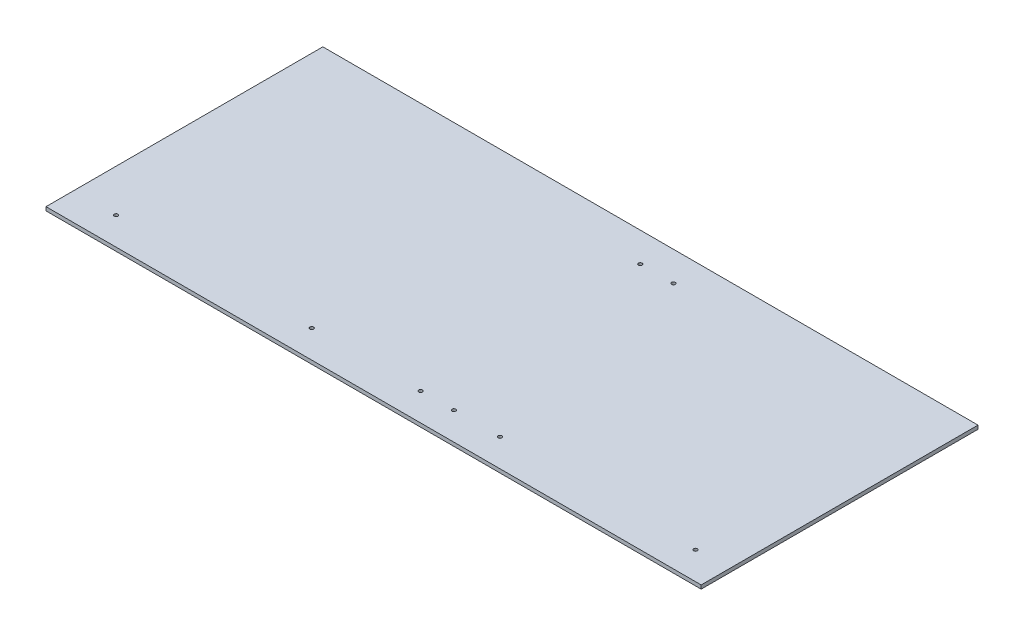
ISO-10303-21;
HEADER;
FILE_DESCRIPTION(('STEP AP214'),'2;1');
FILE_NAME('part.step','',(''),(''),'','','');
FILE_SCHEMA(('AUTOMOTIVE_DESIGN { 1 0 10303 214 1 1 1 1 }'));
ENDSEC;
DATA;
#1=APPLICATION_CONTEXT('core data for automotive mechanical design processes');
#2=APPLICATION_PROTOCOL_DEFINITION('international standard','automotive_design',2000,#1);
#3=PRODUCT_CONTEXT('',#1,'mechanical');
#4=PRODUCT('Part','Part','',(#3));
#5=PRODUCT_RELATED_PRODUCT_CATEGORY('part','',(#4));
#6=PRODUCT_DEFINITION_FORMATION('','',#4);
#7=PRODUCT_DEFINITION_CONTEXT('part definition',#1,'design');
#8=PRODUCT_DEFINITION('design','',#6,#7);
#9=PRODUCT_DEFINITION_SHAPE('','',#8);
#10=(LENGTH_UNIT() NAMED_UNIT(*) SI_UNIT(.MILLI.,.METRE.));
#11=(NAMED_UNIT(*) PLANE_ANGLE_UNIT() SI_UNIT($,.RADIAN.));
#12=(NAMED_UNIT(*) SI_UNIT($,.STERADIAN.) SOLID_ANGLE_UNIT());
#13=UNCERTAINTY_MEASURE_WITH_UNIT(LENGTH_MEASURE(1.E-05),#10,'distance_accuracy_value','');
#14=(GEOMETRIC_REPRESENTATION_CONTEXT(3) GLOBAL_UNCERTAINTY_ASSIGNED_CONTEXT((#13)) GLOBAL_UNIT_ASSIGNED_CONTEXT((#10,
#11,#12)) REPRESENTATION_CONTEXT('',''));
#15=CARTESIAN_POINT('',(0.,0.,0.));
#16=DIRECTION('',(0.,0.,1.));
#17=DIRECTION('',(1.,0.,0.));
#18=AXIS2_PLACEMENT_3D('',#15,#16,#17);
#19=CARTESIAN_POINT('',(-614.3625,0.,238.125));
#20=DIRECTION('',(0.,-1.,0.));
#21=DIRECTION('',(0.,0.,-1.));
#22=AXIS2_PLACEMENT_3D('',#19,#20,#21);
#23=PLANE('',#22);
#24=DIRECTION('',(0.,0.,1.));
#25=VECTOR('',#24,1.);
#26=CARTESIAN_POINT('',(-1177.925,0.,238.125));
#27=LINE('',#26,#25);
#28=CARTESIAN_POINT('',(-1177.925,0.,476.25));
#29=VERTEX_POINT('',#28);
#30=CARTESIAN_POINT('',(-1177.925,0.,0.));
#31=VERTEX_POINT('',#30);
#32=EDGE_CURVE('E309',#29,#31,#27,.F.);
#33=ORIENTED_EDGE('',*,*,#32,.F.);
#34=DIRECTION('',(-1.,0.,0.));
#35=VECTOR('',#34,1.);
#36=CARTESIAN_POINT('',(-614.3625,0.,476.25));
#37=LINE('',#36,#35);
#38=CARTESIAN_POINT('',(-50.8,0.,476.25));
#39=VERTEX_POINT('',#38);
#40=EDGE_CURVE('E69',#29,#39,#37,.F.);
#41=ORIENTED_EDGE('',*,*,#40,.T.);
#42=DIRECTION('',(0.,0.,1.));
#43=VECTOR('',#42,1.);
#44=CARTESIAN_POINT('',(-50.8,0.,238.125));
#45=LINE('',#44,#43);
#46=CARTESIAN_POINT('',(-50.8,0.,0.));
#47=VERTEX_POINT('',#46);
#48=EDGE_CURVE('E53',#39,#47,#45,.F.);
#49=ORIENTED_EDGE('',*,*,#48,.T.);
#50=DIRECTION('',(-1.,0.,0.));
#51=VECTOR('',#50,1.);
#52=CARTESIAN_POINT('',(-614.3625,0.,0.));
#53=LINE('',#52,#51);
#54=EDGE_CURVE('E58',#31,#47,#53,.F.);
#55=ORIENTED_EDGE('',*,*,#54,.F.);
#56=EDGE_LOOP('',(#33,#41,#49,#55));
#57=FACE_BOUND('',#56,.T.);
#58=CARTESIAN_POINT('',(-1104.9,0.,428.625));
#59=DIRECTION('',(0.,-1.,0.));
#60=DIRECTION('',(0.,0.,-1.));
#61=AXIS2_PLACEMENT_3D('',#58,#59,#60);
#62=CIRCLE('',#61,3.175);
#63=CARTESIAN_POINT('',(-1104.9,0.,425.45));
#64=VERTEX_POINT('',#63);
#65=EDGE_CURVE('E66',#64,#64,#62,.T.);
#66=ORIENTED_EDGE('',*,*,#65,.T.);
#67=EDGE_LOOP('',(#66));
#68=FACE_BOUND('',#67,.T.);
#69=CARTESIAN_POINT('',(-581.025,0.,428.625));
#70=DIRECTION('',(0.,-1.,0.));
#71=DIRECTION('',(0.,0.,-1.));
#72=AXIS2_PLACEMENT_3D('',#69,#70,#71);
#73=CIRCLE('',#72,3.175);
#74=CARTESIAN_POINT('',(-581.025,0.,425.45));
#75=VERTEX_POINT('',#74);
#76=EDGE_CURVE('E107',#75,#75,#73,.T.);
#77=ORIENTED_EDGE('',*,*,#76,.T.);
#78=EDGE_LOOP('',(#77));
#79=FACE_BOUND('',#78,.T.);
#80=CARTESIAN_POINT('',(-523.875,0.,428.625));
#81=DIRECTION('',(0.,-1.,0.));
#82=DIRECTION('',(0.,0.,-1.));
#83=AXIS2_PLACEMENT_3D('',#80,#81,#82);
#84=CIRCLE('',#83,3.175);
#85=CARTESIAN_POINT('',(-523.875,0.,425.45));
#86=VERTEX_POINT('',#85);
#87=EDGE_CURVE('E110',#86,#86,#84,.T.);
#88=ORIENTED_EDGE('',*,*,#87,.T.);
#89=EDGE_LOOP('',(#88));
#90=FACE_BOUND('',#89,.T.);
#91=CARTESIAN_POINT('',(-107.95,0.,428.625));
#92=DIRECTION('',(0.,-1.,0.));
#93=DIRECTION('',(0.,0.,-1.));
#94=AXIS2_PLACEMENT_3D('',#91,#92,#93);
#95=CIRCLE('',#94,3.175);
#96=CARTESIAN_POINT('',(-107.95,0.,425.45));
#97=VERTEX_POINT('',#96);
#98=EDGE_CURVE('E113',#97,#97,#95,.T.);
#99=ORIENTED_EDGE('',*,*,#98,.T.);
#100=EDGE_LOOP('',(#99));
#101=FACE_BOUND('',#100,.T.);
#102=CARTESIAN_POINT('',(-523.875,0.,50.8));
#103=DIRECTION('',(0.,-1.,0.));
#104=DIRECTION('',(0.,0.,-1.));
#105=AXIS2_PLACEMENT_3D('',#102,#103,#104);
#106=CIRCLE('',#105,3.175);
#107=CARTESIAN_POINT('',(-523.875,0.,47.625));
#108=VERTEX_POINT('',#107);
#109=EDGE_CURVE('E116',#108,#108,#106,.T.);
#110=ORIENTED_EDGE('',*,*,#109,.T.);
#111=EDGE_LOOP('',(#110));
#112=FACE_BOUND('',#111,.T.);
#113=CARTESIAN_POINT('',(-581.025,0.,50.8));
#114=DIRECTION('',(0.,-1.,0.));
#115=DIRECTION('',(0.,0.,-1.));
#116=AXIS2_PLACEMENT_3D('',#113,#114,#115);
#117=CIRCLE('',#116,3.175);
#118=CARTESIAN_POINT('',(-581.025,0.,47.625));
#119=VERTEX_POINT('',#118);
#120=EDGE_CURVE('E119',#119,#119,#117,.T.);
#121=ORIENTED_EDGE('',*,*,#120,.T.);
#122=EDGE_LOOP('',(#121));
#123=FACE_BOUND('',#122,.T.);
#124=CARTESIAN_POINT('',(-768.35,0.,428.625));
#125=DIRECTION('',(0.,-1.,0.));
#126=DIRECTION('',(0.,0.,-1.));
#127=AXIS2_PLACEMENT_3D('',#124,#125,#126);
#128=CIRCLE('',#127,3.175);
#129=CARTESIAN_POINT('',(-768.35,0.,425.45));
#130=VERTEX_POINT('',#129);
#131=EDGE_CURVE('E121',#130,#130,#128,.T.);
#132=ORIENTED_EDGE('',*,*,#131,.T.);
#133=EDGE_LOOP('',(#132));
#134=FACE_BOUND('',#133,.T.);
#135=CARTESIAN_POINT('',(-444.5,0.,428.625));
#136=DIRECTION('',(0.,-1.,0.));
#137=DIRECTION('',(0.,0.,-1.));
#138=AXIS2_PLACEMENT_3D('',#135,#136,#137);
#139=CIRCLE('',#138,3.175);
#140=CARTESIAN_POINT('',(-444.5,0.,425.45));
#141=VERTEX_POINT('',#140);
#142=EDGE_CURVE('E17',#141,#141,#139,.T.);
#143=ORIENTED_EDGE('',*,*,#142,.T.);
#144=EDGE_LOOP('',(#143));
#145=FACE_BOUND('',#144,.T.);
#146=ADVANCED_FACE('F14',(#57,#68,#79,#90,#101,#112,#123,#134,#145),#23,.F.);
#147=CARTESIAN_POINT('',(-444.5,-7227.09274295138,428.625));
#148=DIRECTION('',(0.,-1.,0.));
#149=DIRECTION('',(0.,0.,-1.));
#150=AXIS2_PLACEMENT_3D('',#147,#148,#149);
#151=CYLINDRICAL_SURFACE('',#150,3.175);
#152=ORIENTED_EDGE('',*,*,#142,.F.);
#153=EDGE_LOOP('',(#152));
#154=FACE_BOUND('',#153,.T.);
#155=CARTESIAN_POINT('',(-444.5,-6.3500000000003,428.625));
#156=DIRECTION('',(0.,-1.,0.));
#157=DIRECTION('',(0.,0.,-1.));
#158=AXIS2_PLACEMENT_3D('',#155,#156,#157);
#159=CIRCLE('',#158,3.175);
#160=CARTESIAN_POINT('',(-444.5,-6.3500000000003,425.45));
#161=VERTEX_POINT('',#160);
#162=EDGE_CURVE('E102',#161,#161,#159,.F.);
#163=ORIENTED_EDGE('',*,*,#162,.F.);
#164=EDGE_LOOP('',(#163));
#165=FACE_BOUND('',#164,.T.);
#166=ADVANCED_FACE('F129',(#154,#165),#151,.F.);
#167=CARTESIAN_POINT('',(-768.35,-7227.09274295138,428.625));
#168=DIRECTION('',(0.,-1.,0.));
#169=DIRECTION('',(0.,0.,-1.));
#170=AXIS2_PLACEMENT_3D('',#167,#168,#169);
#171=CYLINDRICAL_SURFACE('',#170,3.175);
#172=ORIENTED_EDGE('',*,*,#131,.F.);
#173=EDGE_LOOP('',(#172));
#174=FACE_BOUND('',#173,.T.);
#175=CARTESIAN_POINT('',(-768.35,-6.3500000000003,428.625));
#176=DIRECTION('',(0.,-1.,0.));
#177=DIRECTION('',(0.,0.,-1.));
#178=AXIS2_PLACEMENT_3D('',#175,#176,#177);
#179=CIRCLE('',#178,3.175);
#180=CARTESIAN_POINT('',(-768.35,-6.3500000000003,425.45));
#181=VERTEX_POINT('',#180);
#182=EDGE_CURVE('E99',#181,#181,#179,.F.);
#183=ORIENTED_EDGE('',*,*,#182,.F.);
#184=EDGE_LOOP('',(#183));
#185=FACE_BOUND('',#184,.T.);
#186=ADVANCED_FACE('F132',(#174,#185),#171,.F.);
#187=CARTESIAN_POINT('',(-581.025,-7227.09274295138,50.8));
#188=DIRECTION('',(0.,-1.,0.));
#189=DIRECTION('',(0.,0.,-1.));
#190=AXIS2_PLACEMENT_3D('',#187,#188,#189);
#191=CYLINDRICAL_SURFACE('',#190,3.175);
#192=ORIENTED_EDGE('',*,*,#120,.F.);
#193=EDGE_LOOP('',(#192));
#194=FACE_BOUND('',#193,.T.);
#195=CARTESIAN_POINT('',(-581.025,-6.3500000000003,50.8));
#196=DIRECTION('',(0.,-1.,0.));
#197=DIRECTION('',(0.,0.,-1.));
#198=AXIS2_PLACEMENT_3D('',#195,#196,#197);
#199=CIRCLE('',#198,3.175);
#200=CARTESIAN_POINT('',(-581.025,-6.3500000000003,47.625));
#201=VERTEX_POINT('',#200);
#202=EDGE_CURVE('E96',#201,#201,#199,.F.);
#203=ORIENTED_EDGE('',*,*,#202,.F.);
#204=EDGE_LOOP('',(#203));
#205=FACE_BOUND('',#204,.T.);
#206=ADVANCED_FACE('F175',(#194,#205),#191,.F.);
#207=CARTESIAN_POINT('',(-523.875,-7227.09274295138,50.8));
#208=DIRECTION('',(0.,-1.,0.));
#209=DIRECTION('',(0.,0.,-1.));
#210=AXIS2_PLACEMENT_3D('',#207,#208,#209);
#211=CYLINDRICAL_SURFACE('',#210,3.175);
#212=ORIENTED_EDGE('',*,*,#109,.F.);
#213=EDGE_LOOP('',(#212));
#214=FACE_BOUND('',#213,.T.);
#215=CARTESIAN_POINT('',(-523.875,-6.3500000000003,50.8));
#216=DIRECTION('',(0.,-1.,0.));
#217=DIRECTION('',(0.,0.,-1.));
#218=AXIS2_PLACEMENT_3D('',#215,#216,#217);
#219=CIRCLE('',#218,3.175);
#220=CARTESIAN_POINT('',(-523.875,-6.3500000000003,47.625));
#221=VERTEX_POINT('',#220);
#222=EDGE_CURVE('E93',#221,#221,#219,.F.);
#223=ORIENTED_EDGE('',*,*,#222,.F.);
#224=EDGE_LOOP('',(#223));
#225=FACE_BOUND('',#224,.T.);
#226=ADVANCED_FACE('F171',(#214,#225),#211,.F.);
#227=CARTESIAN_POINT('',(-107.95,-7227.09274295138,428.625));
#228=DIRECTION('',(0.,-1.,0.));
#229=DIRECTION('',(0.,0.,-1.));
#230=AXIS2_PLACEMENT_3D('',#227,#228,#229);
#231=CYLINDRICAL_SURFACE('',#230,3.175);
#232=ORIENTED_EDGE('',*,*,#98,.F.);
#233=EDGE_LOOP('',(#232));
#234=FACE_BOUND('',#233,.T.);
#235=CARTESIAN_POINT('',(-107.95,-6.3500000000003,428.625));
#236=DIRECTION('',(0.,-1.,0.));
#237=DIRECTION('',(0.,0.,-1.));
#238=AXIS2_PLACEMENT_3D('',#235,#236,#237);
#239=CIRCLE('',#238,3.175);
#240=CARTESIAN_POINT('',(-107.95,-6.3500000000003,425.45));
#241=VERTEX_POINT('',#240);
#242=EDGE_CURVE('E90',#241,#241,#239,.F.);
#243=ORIENTED_EDGE('',*,*,#242,.F.);
#244=EDGE_LOOP('',(#243));
#245=FACE_BOUND('',#244,.T.);
#246=ADVANCED_FACE('F167',(#234,#245),#231,.F.);
#247=CARTESIAN_POINT('',(-523.875,-7227.09274295138,428.625));
#248=DIRECTION('',(0.,-1.,0.));
#249=DIRECTION('',(0.,0.,-1.));
#250=AXIS2_PLACEMENT_3D('',#247,#248,#249);
#251=CYLINDRICAL_SURFACE('',#250,3.175);
#252=ORIENTED_EDGE('',*,*,#87,.F.);
#253=EDGE_LOOP('',(#252));
#254=FACE_BOUND('',#253,.T.);
#255=CARTESIAN_POINT('',(-523.875,-6.3500000000003,428.625));
#256=DIRECTION('',(0.,-1.,0.));
#257=DIRECTION('',(0.,0.,-1.));
#258=AXIS2_PLACEMENT_3D('',#255,#256,#257);
#259=CIRCLE('',#258,3.175);
#260=CARTESIAN_POINT('',(-523.875,-6.3500000000003,425.45));
#261=VERTEX_POINT('',#260);
#262=EDGE_CURVE('E87',#261,#261,#259,.F.);
#263=ORIENTED_EDGE('',*,*,#262,.F.);
#264=EDGE_LOOP('',(#263));
#265=FACE_BOUND('',#264,.T.);
#266=ADVANCED_FACE('F163',(#254,#265),#251,.F.);
#267=CARTESIAN_POINT('',(-581.025,-7227.09274295138,428.625));
#268=DIRECTION('',(0.,-1.,0.));
#269=DIRECTION('',(0.,0.,-1.));
#270=AXIS2_PLACEMENT_3D('',#267,#268,#269);
#271=CYLINDRICAL_SURFACE('',#270,3.175);
#272=ORIENTED_EDGE('',*,*,#76,.F.);
#273=EDGE_LOOP('',(#272));
#274=FACE_BOUND('',#273,.T.);
#275=CARTESIAN_POINT('',(-581.025,-6.3500000000003,428.625));
#276=DIRECTION('',(0.,-1.,0.));
#277=DIRECTION('',(0.,0.,-1.));
#278=AXIS2_PLACEMENT_3D('',#275,#276,#277);
#279=CIRCLE('',#278,3.175);
#280=CARTESIAN_POINT('',(-581.025,-6.3500000000003,425.45));
#281=VERTEX_POINT('',#280);
#282=EDGE_CURVE('E84',#281,#281,#279,.F.);
#283=ORIENTED_EDGE('',*,*,#282,.F.);
#284=EDGE_LOOP('',(#283));
#285=FACE_BOUND('',#284,.T.);
#286=ADVANCED_FACE('F159',(#274,#285),#271,.F.);
#287=CARTESIAN_POINT('',(-1104.9,-7227.09274295138,428.625));
#288=DIRECTION('',(0.,-1.,0.));
#289=DIRECTION('',(0.,0.,-1.));
#290=AXIS2_PLACEMENT_3D('',#287,#288,#289);
#291=CYLINDRICAL_SURFACE('',#290,3.175);
#292=ORIENTED_EDGE('',*,*,#65,.F.);
#293=EDGE_LOOP('',(#292));
#294=FACE_BOUND('',#293,.T.);
#295=CARTESIAN_POINT('',(-1104.9,-6.3500000000003,428.625));
#296=DIRECTION('',(0.,-1.,0.));
#297=DIRECTION('',(0.,0.,-1.));
#298=AXIS2_PLACEMENT_3D('',#295,#296,#297);
#299=CIRCLE('',#298,3.175);
#300=CARTESIAN_POINT('',(-1104.9,-6.3500000000003,425.45));
#301=VERTEX_POINT('',#300);
#302=EDGE_CURVE('E80',#301,#301,#299,.F.);
#303=ORIENTED_EDGE('',*,*,#302,.F.);
#304=EDGE_LOOP('',(#303));
#305=FACE_BOUND('',#304,.T.);
#306=ADVANCED_FACE('F156',(#294,#305),#291,.F.);
#307=CARTESIAN_POINT('',(-614.3625,-6.35,0.));
#308=DIRECTION('',(0.,0.,-1.));
#309=DIRECTION('',(-1.,0.,0.));
#310=AXIS2_PLACEMENT_3D('',#307,#308,#309);
#311=PLANE('',#310);
#312=DIRECTION('',(1.,0.,0.));
#313=VECTOR('',#312,1.);
#314=CARTESIAN_POINT('',(-614.3625,-6.35,0.));
#315=LINE('',#314,#313);
#316=CARTESIAN_POINT('',(-1177.925,-6.35,0.));
#317=VERTEX_POINT('',#316);
#318=CARTESIAN_POINT('',(-50.8,-6.35,0.));
#319=VERTEX_POINT('',#318);
#320=EDGE_CURVE('E83',#317,#319,#315,.T.);
#321=ORIENTED_EDGE('',*,*,#320,.F.);
#322=DIRECTION('',(0.,1.,0.));
#323=VECTOR('',#322,1.);
#324=CARTESIAN_POINT('',(-1177.925,-6.35,0.));
#325=LINE('',#324,#323);
#326=EDGE_CURVE('E63',#31,#317,#325,.F.);
#327=ORIENTED_EDGE('',*,*,#326,.F.);
#328=ORIENTED_EDGE('',*,*,#54,.T.);
#329=DIRECTION('',(0.,1.,0.));
#330=VECTOR('',#329,1.);
#331=CARTESIAN_POINT('',(-50.8,-6.35,0.));
#332=LINE('',#331,#330);
#333=EDGE_CURVE('E60',#47,#319,#332,.F.);
#334=ORIENTED_EDGE('',*,*,#333,.T.);
#335=EDGE_LOOP('',(#321,#327,#328,#334));
#336=FACE_BOUND('',#335,.T.);
#337=ADVANCED_FACE('F59',(#336),#311,.T.);
#338=CARTESIAN_POINT('',(-50.8,-6.35,238.125));
#339=DIRECTION('',(-1.,0.,0.));
#340=DIRECTION('',(0.,0.,1.));
#341=AXIS2_PLACEMENT_3D('',#338,#339,#340);
#342=PLANE('',#341);
#343=DIRECTION('',(0.,1.,0.));
#344=VECTOR('',#343,1.);
#345=CARTESIAN_POINT('',(-50.8,-6.35,476.25));
#346=LINE('',#345,#344);
#347=CARTESIAN_POINT('',(-50.8,-6.35,476.25));
#348=VERTEX_POINT('',#347);
#349=EDGE_CURVE('E71',#39,#348,#346,.F.);
#350=ORIENTED_EDGE('',*,*,#349,.T.);
#351=DIRECTION('',(0.,0.,-1.));
#352=VECTOR('',#351,1.);
#353=CARTESIAN_POINT('',(-50.8,-6.35,238.125));
#354=LINE('',#353,#352);
#355=EDGE_CURVE('E75',#319,#348,#354,.F.);
#356=ORIENTED_EDGE('',*,*,#355,.F.);
#357=ORIENTED_EDGE('',*,*,#333,.F.);
#358=ORIENTED_EDGE('',*,*,#48,.F.);
#359=EDGE_LOOP('',(#350,#356,#357,#358));
#360=FACE_BOUND('',#359,.T.);
#361=ADVANCED_FACE('F73',(#360),#342,.F.);
#362=CARTESIAN_POINT('',(-614.3625,-6.35,476.25));
#363=DIRECTION('',(0.,0.,-1.));
#364=DIRECTION('',(-1.,0.,0.));
#365=AXIS2_PLACEMENT_3D('',#362,#363,#364);
#366=PLANE('',#365);
#367=DIRECTION('',(0.,1.,0.));
#368=VECTOR('',#367,1.);
#369=CARTESIAN_POINT('',(-1177.925,-6.35,476.25));
#370=LINE('',#369,#368);
#371=CARTESIAN_POINT('',(-1177.925,-6.35,476.25));
#372=VERTEX_POINT('',#371);
#373=EDGE_CURVE('E32',#372,#29,#370,.T.);
#374=ORIENTED_EDGE('',*,*,#373,.F.);
#375=DIRECTION('',(1.,0.,0.));
#376=VECTOR('',#375,1.);
#377=CARTESIAN_POINT('',(-614.3625,-6.35,476.25));
#378=LINE('',#377,#376);
#379=EDGE_CURVE('E23',#348,#372,#378,.F.);
#380=ORIENTED_EDGE('',*,*,#379,.F.);
#381=ORIENTED_EDGE('',*,*,#349,.F.);
#382=ORIENTED_EDGE('',*,*,#40,.F.);
#383=EDGE_LOOP('',(#374,#380,#381,#382));
#384=FACE_BOUND('',#383,.T.);
#385=ADVANCED_FACE('F144',(#384),#366,.F.);
#386=CARTESIAN_POINT('',(-1177.925,-6.35,238.125));
#387=DIRECTION('',(-1.,0.,0.));
#388=DIRECTION('',(0.,0.,1.));
#389=AXIS2_PLACEMENT_3D('',#386,#387,#388);
#390=PLANE('',#389);
#391=DIRECTION('',(0.,0.,-1.));
#392=VECTOR('',#391,1.);
#393=CARTESIAN_POINT('',(-1177.925,-6.35,238.125));
#394=LINE('',#393,#392);
#395=EDGE_CURVE('E9',#372,#317,#394,.T.);
#396=ORIENTED_EDGE('',*,*,#395,.F.);
#397=ORIENTED_EDGE('',*,*,#373,.T.);
#398=ORIENTED_EDGE('',*,*,#32,.T.);
#399=ORIENTED_EDGE('',*,*,#326,.T.);
#400=EDGE_LOOP('',(#396,#397,#398,#399));
#401=FACE_BOUND('',#400,.T.);
#402=ADVANCED_FACE('F137',(#401),#390,.T.);
#403=CARTESIAN_POINT('',(-614.3625,-6.35,238.125));
#404=DIRECTION('',(0.,-1.,0.));
#405=DIRECTION('',(0.,0.,-1.));
#406=AXIS2_PLACEMENT_3D('',#403,#404,#405);
#407=PLANE('',#406);
#408=ORIENTED_EDGE('',*,*,#379,.T.);
#409=ORIENTED_EDGE('',*,*,#395,.T.);
#410=ORIENTED_EDGE('',*,*,#320,.T.);
#411=ORIENTED_EDGE('',*,*,#355,.T.);
#412=EDGE_LOOP('',(#408,#409,#410,#411));
#413=FACE_BOUND('',#412,.T.);
#414=ORIENTED_EDGE('',*,*,#302,.T.);
#415=EDGE_LOOP('',(#414));
#416=FACE_BOUND('',#415,.T.);
#417=ORIENTED_EDGE('',*,*,#282,.T.);
#418=EDGE_LOOP('',(#417));
#419=FACE_BOUND('',#418,.T.);
#420=ORIENTED_EDGE('',*,*,#262,.T.);
#421=EDGE_LOOP('',(#420));
#422=FACE_BOUND('',#421,.T.);
#423=ORIENTED_EDGE('',*,*,#242,.T.);
#424=EDGE_LOOP('',(#423));
#425=FACE_BOUND('',#424,.T.);
#426=ORIENTED_EDGE('',*,*,#222,.T.);
#427=EDGE_LOOP('',(#426));
#428=FACE_BOUND('',#427,.T.);
#429=ORIENTED_EDGE('',*,*,#202,.T.);
#430=EDGE_LOOP('',(#429));
#431=FACE_BOUND('',#430,.T.);
#432=ORIENTED_EDGE('',*,*,#182,.T.);
#433=EDGE_LOOP('',(#432));
#434=FACE_BOUND('',#433,.T.);
#435=ORIENTED_EDGE('',*,*,#162,.T.);
#436=EDGE_LOOP('',(#435));
#437=FACE_BOUND('',#436,.T.);
#438=ADVANCED_FACE('F135',(#413,#416,#419,#422,#425,#428,#431,#434,#437),#407,.T.);
#439=CLOSED_SHELL('',(#146,#166,#186,#206,#226,#246,#266,#286,#306,#337,#361,#385,#402,#438));
#440=MANIFOLD_SOLID_BREP('B1',#439);
#441=ADVANCED_BREP_SHAPE_REPRESENTATION('',(#18,#440),#14);
#442=SHAPE_DEFINITION_REPRESENTATION(#9,#441);
ENDSEC;
END-ISO-10303-21;
